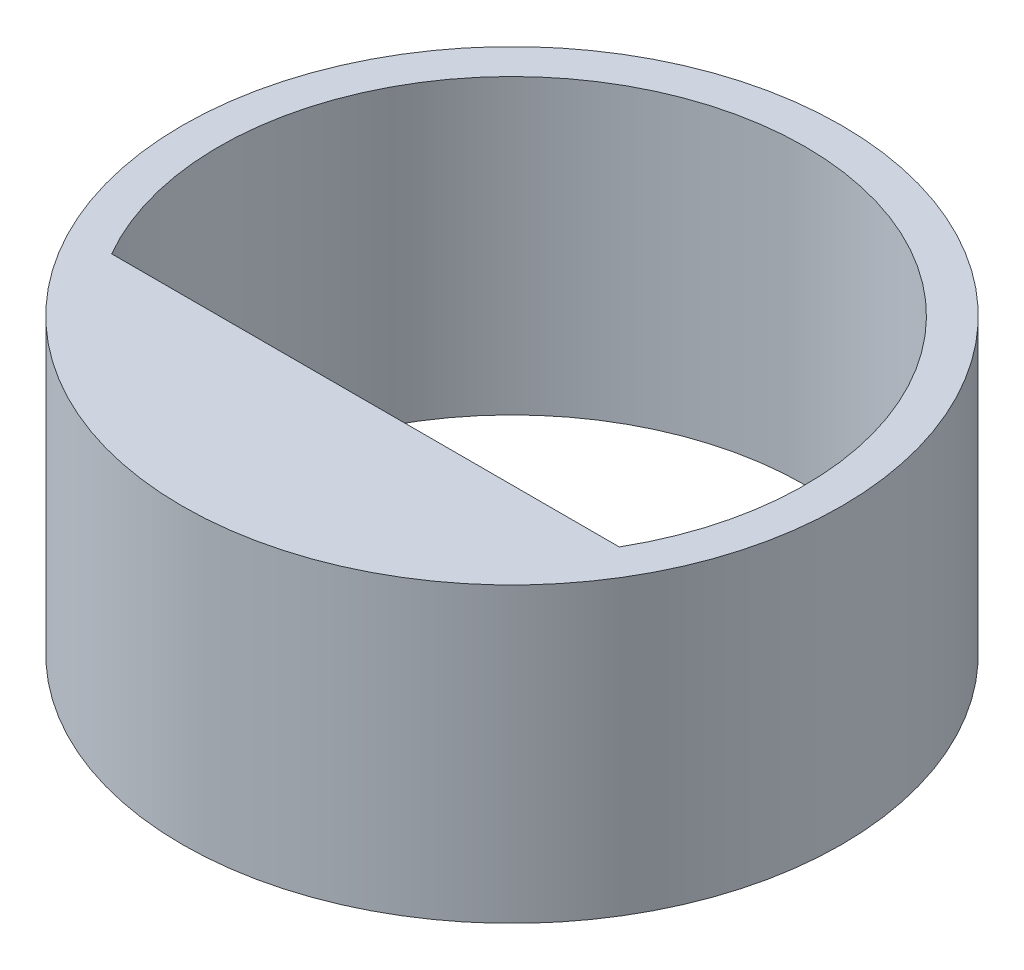
ISO-10303-21;
HEADER;
FILE_DESCRIPTION(('STEP AP214'),'2;1');
FILE_NAME('part.step','',(''),(''),'','','');
FILE_SCHEMA(('AUTOMOTIVE_DESIGN { 1 0 10303 214 1 1 1 1 }'));
ENDSEC;
DATA;
#1=APPLICATION_CONTEXT('core data for automotive mechanical design processes');
#2=APPLICATION_PROTOCOL_DEFINITION('international standard','automotive_design',2000,#1);
#3=PRODUCT_CONTEXT('',#1,'mechanical');
#4=PRODUCT('Part','Part','',(#3));
#5=PRODUCT_RELATED_PRODUCT_CATEGORY('part','',(#4));
#6=PRODUCT_DEFINITION_FORMATION('','',#4);
#7=PRODUCT_DEFINITION_CONTEXT('part definition',#1,'design');
#8=PRODUCT_DEFINITION('design','',#6,#7);
#9=PRODUCT_DEFINITION_SHAPE('','',#8);
#10=(LENGTH_UNIT() NAMED_UNIT(*) SI_UNIT(.MILLI.,.METRE.));
#11=(NAMED_UNIT(*) PLANE_ANGLE_UNIT() SI_UNIT($,.RADIAN.));
#12=(NAMED_UNIT(*) SI_UNIT($,.STERADIAN.) SOLID_ANGLE_UNIT());
#13=UNCERTAINTY_MEASURE_WITH_UNIT(LENGTH_MEASURE(1.E-05),#10,'distance_accuracy_value','');
#14=(GEOMETRIC_REPRESENTATION_CONTEXT(3) GLOBAL_UNCERTAINTY_ASSIGNED_CONTEXT((#13)) GLOBAL_UNIT_ASSIGNED_CONTEXT((#10,
#11,#12)) REPRESENTATION_CONTEXT('',''));
#15=CARTESIAN_POINT('',(0.,0.,0.));
#16=DIRECTION('',(0.,0.,1.));
#17=DIRECTION('',(1.,0.,0.));
#18=AXIS2_PLACEMENT_3D('',#15,#16,#17);
#19=CARTESIAN_POINT('',(0.,2.,0.));
#20=DIRECTION('',(0.,1.,0.));
#21=DIRECTION('',(0.,0.,1.));
#22=AXIS2_PLACEMENT_3D('',#19,#20,#21);
#23=PLANE('',#22);
#24=CARTESIAN_POINT('',(0.,2.,0.));
#25=DIRECTION('',(0.,1.,0.));
#26=DIRECTION('',(0.,0.,1.));
#27=AXIS2_PLACEMENT_3D('',#24,#25,#26);
#28=CIRCLE('',#27,2.25);
#29=CARTESIAN_POINT('',(0.,2.,2.25));
#30=VERTEX_POINT('',#29);
#31=EDGE_CURVE('E11',#30,#30,#28,.T.);
#32=ORIENTED_EDGE('',*,*,#31,.T.);
#33=EDGE_LOOP('',(#32));
#34=FACE_BOUND('',#33,.T.);
#35=DIRECTION('',(1.,0.,0.));
#36=VECTOR('',#35,1.);
#37=CARTESIAN_POINT('',(-1.73205080756888,2.,1.));
#38=LINE('',#37,#36);
#39=CARTESIAN_POINT('',(-1.73205080756888,2.,1.));
#40=VERTEX_POINT('',#39);
#41=CARTESIAN_POINT('',(1.73205080756888,2.,1.));
#42=VERTEX_POINT('',#41);
#43=EDGE_CURVE('E71',#40,#42,#38,.T.);
#44=ORIENTED_EDGE('',*,*,#43,.F.);
#45=CARTESIAN_POINT('',(0.,2.,0.));
#46=DIRECTION('',(0.,1.,0.));
#47=DIRECTION('',(0.,0.,-1.));
#48=AXIS2_PLACEMENT_3D('',#45,#46,#47);
#49=CIRCLE('',#48,2.);
#50=EDGE_CURVE('E62',#42,#40,#49,.T.);
#51=ORIENTED_EDGE('',*,*,#50,.F.);
#52=EDGE_LOOP('',(#44,#51));
#53=FACE_BOUND('',#52,.T.);
#54=ADVANCED_FACE('F30',(#34,#53),#23,.T.);
#55=CARTESIAN_POINT('',(0.,0.,0.));
#56=DIRECTION('',(0.,1.,0.));
#57=DIRECTION('',(0.,0.,1.));
#58=AXIS2_PLACEMENT_3D('',#55,#56,#57);
#59=PLANE('',#58);
#60=CARTESIAN_POINT('',(0.,0.,0.));
#61=DIRECTION('',(0.,1.,0.));
#62=DIRECTION('',(0.,0.,1.));
#63=AXIS2_PLACEMENT_3D('',#60,#61,#62);
#64=CIRCLE('',#63,2.25);
#65=CARTESIAN_POINT('',(0.,0.,2.25));
#66=VERTEX_POINT('',#65);
#67=EDGE_CURVE('E34',#66,#66,#64,.T.);
#68=ORIENTED_EDGE('',*,*,#67,.F.);
#69=EDGE_LOOP('',(#68));
#70=FACE_BOUND('',#69,.T.);
#71=CARTESIAN_POINT('',(0.,0.,0.));
#72=DIRECTION('',(0.,1.,0.));
#73=DIRECTION('',(0.,0.,-1.));
#74=AXIS2_PLACEMENT_3D('',#71,#72,#73);
#75=CIRCLE('',#74,2.);
#76=CARTESIAN_POINT('',(1.73205080756888,0.,1.));
#77=VERTEX_POINT('',#76);
#78=CARTESIAN_POINT('',(-1.73205080756888,0.,1.));
#79=VERTEX_POINT('',#78);
#80=EDGE_CURVE('E52',#77,#79,#75,.T.);
#81=ORIENTED_EDGE('',*,*,#80,.T.);
#82=DIRECTION('',(1.,0.,0.));
#83=VECTOR('',#82,1.);
#84=CARTESIAN_POINT('',(-1.73205080756888,0.,1.));
#85=LINE('',#84,#83);
#86=EDGE_CURVE('E58',#79,#77,#85,.T.);
#87=ORIENTED_EDGE('',*,*,#86,.T.);
#88=EDGE_LOOP('',(#81,#87));
#89=FACE_BOUND('',#88,.T.);
#90=ADVANCED_FACE('F68',(#70,#89),#59,.F.);
#91=CARTESIAN_POINT('',(0.,2.,0.));
#92=DIRECTION('',(0.,-1.,0.));
#93=DIRECTION('',(0.,0.,-1.));
#94=AXIS2_PLACEMENT_3D('',#91,#92,#93);
#95=CYLINDRICAL_SURFACE('',#94,2.25);
#96=ORIENTED_EDGE('',*,*,#31,.F.);
#97=EDGE_LOOP('',(#96));
#98=FACE_BOUND('',#97,.T.);
#99=ORIENTED_EDGE('',*,*,#67,.T.);
#100=EDGE_LOOP('',(#99));
#101=FACE_BOUND('',#100,.T.);
#102=ADVANCED_FACE('F32',(#98,#101),#95,.T.);
#103=CARTESIAN_POINT('',(0.,2.,0.));
#104=DIRECTION('',(0.,-1.,0.));
#105=DIRECTION('',(0.,0.,-1.));
#106=AXIS2_PLACEMENT_3D('',#103,#104,#105);
#107=CYLINDRICAL_SURFACE('',#106,2.);
#108=ORIENTED_EDGE('',*,*,#80,.F.);
#109=DIRECTION('',(0.,-1.,0.));
#110=VECTOR('',#109,1.);
#111=CARTESIAN_POINT('',(1.73205080756888,2.,1.));
#112=LINE('',#111,#110);
#113=EDGE_CURVE('E60',#42,#77,#112,.T.);
#114=ORIENTED_EDGE('',*,*,#113,.F.);
#115=ORIENTED_EDGE('',*,*,#50,.T.);
#116=DIRECTION('',(0.,-1.,0.));
#117=VECTOR('',#116,1.);
#118=CARTESIAN_POINT('',(-1.73205080756888,2.,1.));
#119=LINE('',#118,#117);
#120=EDGE_CURVE('E45',#40,#79,#119,.T.);
#121=ORIENTED_EDGE('',*,*,#120,.T.);
#122=EDGE_LOOP('',(#108,#114,#115,#121));
#123=FACE_BOUND('',#122,.T.);
#124=ADVANCED_FACE('F64',(#123),#107,.F.);
#125=CARTESIAN_POINT('',(-1.73205080756888,2.,1.));
#126=DIRECTION('',(0.,0.,-1.));
#127=DIRECTION('',(-1.,0.,0.));
#128=AXIS2_PLACEMENT_3D('',#125,#126,#127);
#129=PLANE('',#128);
#130=ORIENTED_EDGE('',*,*,#86,.F.);
#131=ORIENTED_EDGE('',*,*,#120,.F.);
#132=ORIENTED_EDGE('',*,*,#43,.T.);
#133=ORIENTED_EDGE('',*,*,#113,.T.);
#134=EDGE_LOOP('',(#130,#131,#132,#133));
#135=FACE_BOUND('',#134,.T.);
#136=ADVANCED_FACE('F59',(#135),#129,.T.);
#137=CLOSED_SHELL('',(#54,#90,#102,#124,#136));
#138=MANIFOLD_SOLID_BREP('B2',#137);
#139=ADVANCED_BREP_SHAPE_REPRESENTATION('',(#18,#138),#14);
#140=SHAPE_DEFINITION_REPRESENTATION(#9,#139);
ENDSEC;
END-ISO-10303-21;
